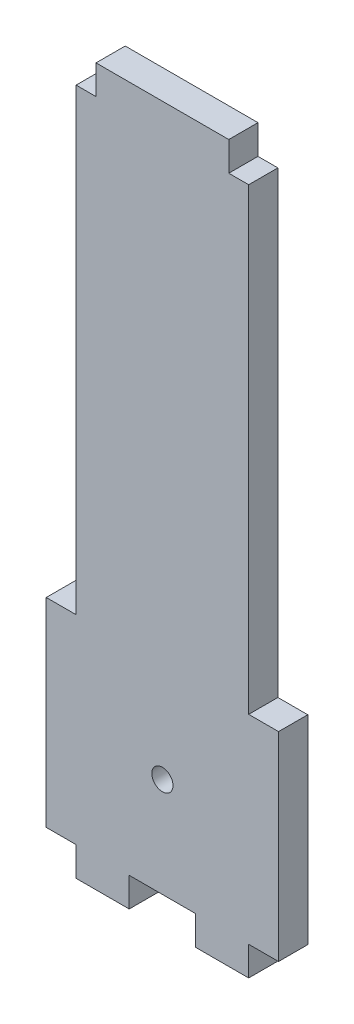
ISO-10303-21;
HEADER;
FILE_DESCRIPTION(('STEP AP214'),'2;1');
FILE_NAME('part.step','',(''),(''),'','','');
FILE_SCHEMA(('AUTOMOTIVE_DESIGN { 1 0 10303 214 1 1 1 1 }'));
ENDSEC;
DATA;
#1=APPLICATION_CONTEXT('core data for automotive mechanical design processes');
#2=APPLICATION_PROTOCOL_DEFINITION('international standard','automotive_design',2000,#1);
#3=PRODUCT_CONTEXT('',#1,'mechanical');
#4=PRODUCT('Part','Part','',(#3));
#5=PRODUCT_RELATED_PRODUCT_CATEGORY('part','',(#4));
#6=PRODUCT_DEFINITION_FORMATION('','',#4);
#7=PRODUCT_DEFINITION_CONTEXT('part definition',#1,'design');
#8=PRODUCT_DEFINITION('design','',#6,#7);
#9=PRODUCT_DEFINITION_SHAPE('','',#8);
#10=(LENGTH_UNIT() NAMED_UNIT(*) SI_UNIT(.MILLI.,.METRE.));
#11=(NAMED_UNIT(*) PLANE_ANGLE_UNIT() SI_UNIT($,.RADIAN.));
#12=(NAMED_UNIT(*) SI_UNIT($,.STERADIAN.) SOLID_ANGLE_UNIT());
#13=UNCERTAINTY_MEASURE_WITH_UNIT(LENGTH_MEASURE(1.E-05),#10,'distance_accuracy_value','');
#14=(GEOMETRIC_REPRESENTATION_CONTEXT(3) GLOBAL_UNCERTAINTY_ASSIGNED_CONTEXT((#13)) GLOBAL_UNIT_ASSIGNED_CONTEXT((#10,
#11,#12)) REPRESENTATION_CONTEXT('',''));
#15=CARTESIAN_POINT('',(0.,0.,0.));
#16=DIRECTION('',(0.,0.,1.));
#17=DIRECTION('',(1.,0.,0.));
#18=AXIS2_PLACEMENT_3D('',#15,#16,#17);
#19=CARTESIAN_POINT('',(-13.,19.4,4.4));
#20=DIRECTION('',(1.,0.,0.));
#21=DIRECTION('',(0.,0.,-1.));
#22=AXIS2_PLACEMENT_3D('',#19,#20,#21);
#23=PLANE('',#22);
#24=DIRECTION('',(0.,-1.,0.));
#25=VECTOR('',#24,1.);
#26=CARTESIAN_POINT('',(-13.,19.4,0.));
#27=LINE('',#26,#25);
#28=CARTESIAN_POINT('',(-13.,84.1,0.));
#29=VERTEX_POINT('',#28);
#30=CARTESIAN_POINT('',(-13.,15.,0.));
#31=VERTEX_POINT('',#30);
#32=EDGE_CURVE('E176',#29,#31,#27,.T.);
#33=ORIENTED_EDGE('',*,*,#32,.T.);
#34=DIRECTION('',(0.,0.,-1.));
#35=VECTOR('',#34,1.);
#36=CARTESIAN_POINT('',(-13.,15.,4.4));
#37=LINE('',#36,#35);
#38=CARTESIAN_POINT('',(-13.,15.,4.4));
#39=VERTEX_POINT('',#38);
#40=EDGE_CURVE('E11',#39,#31,#37,.T.);
#41=ORIENTED_EDGE('',*,*,#40,.F.);
#42=DIRECTION('',(0.,-1.,0.));
#43=VECTOR('',#42,1.);
#44=CARTESIAN_POINT('',(-13.,19.4,4.4));
#45=LINE('',#44,#43);
#46=CARTESIAN_POINT('',(-13.,84.1,4.4));
#47=VERTEX_POINT('',#46);
#48=EDGE_CURVE('E114',#47,#39,#45,.T.);
#49=ORIENTED_EDGE('',*,*,#48,.F.);
#50=DIRECTION('',(0.,0.,1.));
#51=VECTOR('',#50,1.);
#52=CARTESIAN_POINT('',(-13.,84.1,-77.9631323126515));
#53=LINE('',#52,#51);
#54=EDGE_CURVE('E328',#29,#47,#53,.T.);
#55=ORIENTED_EDGE('',*,*,#54,.F.);
#56=EDGE_LOOP('',(#33,#41,#49,#55));
#57=FACE_BOUND('',#56,.T.);
#58=ADVANCED_FACE('F35',(#57),#23,.F.);
#59=CARTESIAN_POINT('',(-13.,15.,4.4));
#60=DIRECTION('',(0.,-1.,0.));
#61=DIRECTION('',(1.,0.,0.));
#62=AXIS2_PLACEMENT_3D('',#59,#60,#61);
#63=PLANE('',#62);
#64=DIRECTION('',(-1.,0.,0.));
#65=VECTOR('',#64,1.);
#66=CARTESIAN_POINT('',(-13.,15.,0.));
#67=LINE('',#66,#65);
#68=CARTESIAN_POINT('',(-17.5,15.,0.));
#69=VERTEX_POINT('',#68);
#70=EDGE_CURVE('E178',#31,#69,#67,.T.);
#71=ORIENTED_EDGE('',*,*,#70,.T.);
#72=DIRECTION('',(0.,0.,-1.));
#73=VECTOR('',#72,1.);
#74=CARTESIAN_POINT('',(-17.5,15.,4.4));
#75=LINE('',#74,#73);
#76=CARTESIAN_POINT('',(-17.5,15.,4.4));
#77=VERTEX_POINT('',#76);
#78=EDGE_CURVE('E44',#77,#69,#75,.T.);
#79=ORIENTED_EDGE('',*,*,#78,.F.);
#80=DIRECTION('',(-1.,0.,0.));
#81=VECTOR('',#80,1.);
#82=CARTESIAN_POINT('',(-13.,15.,4.4));
#83=LINE('',#82,#81);
#84=EDGE_CURVE('E330',#39,#77,#83,.T.);
#85=ORIENTED_EDGE('',*,*,#84,.F.);
#86=ORIENTED_EDGE('',*,*,#40,.T.);
#87=EDGE_LOOP('',(#71,#79,#85,#86));
#88=FACE_BOUND('',#87,.T.);
#89=ADVANCED_FACE('F375',(#88),#63,.F.);
#90=CARTESIAN_POINT('',(-17.5,15.,4.4));
#91=DIRECTION('',(1.,0.,0.));
#92=DIRECTION('',(0.,0.,-1.));
#93=AXIS2_PLACEMENT_3D('',#90,#91,#92);
#94=PLANE('',#93);
#95=DIRECTION('',(0.,-1.,0.));
#96=VECTOR('',#95,1.);
#97=CARTESIAN_POINT('',(-17.5,15.,0.));
#98=LINE('',#97,#96);
#99=CARTESIAN_POINT('',(-17.5,-15.,0.));
#100=VERTEX_POINT('',#99);
#101=EDGE_CURVE('E180',#69,#100,#98,.T.);
#102=ORIENTED_EDGE('',*,*,#101,.T.);
#103=DIRECTION('',(0.,0.,-1.));
#104=VECTOR('',#103,1.);
#105=CARTESIAN_POINT('',(-17.5,-15.,4.4));
#106=LINE('',#105,#104);
#107=CARTESIAN_POINT('',(-17.5,-15.,4.4));
#108=VERTEX_POINT('',#107);
#109=EDGE_CURVE('E228',#108,#100,#106,.T.);
#110=ORIENTED_EDGE('',*,*,#109,.F.);
#111=DIRECTION('',(0.,-1.,0.));
#112=VECTOR('',#111,1.);
#113=CARTESIAN_POINT('',(-17.5,15.,4.4));
#114=LINE('',#113,#112);
#115=EDGE_CURVE('E238',#77,#108,#114,.T.);
#116=ORIENTED_EDGE('',*,*,#115,.F.);
#117=ORIENTED_EDGE('',*,*,#78,.T.);
#118=EDGE_LOOP('',(#102,#110,#116,#117));
#119=FACE_BOUND('',#118,.T.);
#120=ADVANCED_FACE('F236',(#119),#94,.F.);
#121=CARTESIAN_POINT('',(-13.,-15.,4.4));
#122=DIRECTION('',(0.,1.,0.));
#123=DIRECTION('',(-1.,0.,0.));
#124=AXIS2_PLACEMENT_3D('',#121,#122,#123);
#125=PLANE('',#124);
#126=DIRECTION('',(1.,0.,0.));
#127=VECTOR('',#126,1.);
#128=CARTESIAN_POINT('',(-13.,-15.,0.));
#129=LINE('',#128,#127);
#130=CARTESIAN_POINT('',(-13.,-15.,0.));
#131=VERTEX_POINT('',#130);
#132=EDGE_CURVE('E182',#100,#131,#129,.T.);
#133=ORIENTED_EDGE('',*,*,#132,.T.);
#134=DIRECTION('',(0.,0.,-1.));
#135=VECTOR('',#134,1.);
#136=CARTESIAN_POINT('',(-13.,-15.,4.4));
#137=LINE('',#136,#135);
#138=CARTESIAN_POINT('',(-13.,-15.,4.4));
#139=VERTEX_POINT('',#138);
#140=EDGE_CURVE('E225',#139,#131,#137,.T.);
#141=ORIENTED_EDGE('',*,*,#140,.F.);
#142=DIRECTION('',(1.,0.,0.));
#143=VECTOR('',#142,1.);
#144=CARTESIAN_POINT('',(-13.,-15.,4.4));
#145=LINE('',#144,#143);
#146=EDGE_CURVE('E260',#108,#139,#145,.T.);
#147=ORIENTED_EDGE('',*,*,#146,.F.);
#148=ORIENTED_EDGE('',*,*,#109,.T.);
#149=EDGE_LOOP('',(#133,#141,#147,#148));
#150=FACE_BOUND('',#149,.T.);
#151=ADVANCED_FACE('F251',(#150),#125,.F.);
#152=CARTESIAN_POINT('',(-13.,-19.4,4.4));
#153=DIRECTION('',(1.,0.,0.));
#154=DIRECTION('',(0.,0.,-1.));
#155=AXIS2_PLACEMENT_3D('',#152,#153,#154);
#156=PLANE('',#155);
#157=DIRECTION('',(0.,-1.,0.));
#158=VECTOR('',#157,1.);
#159=CARTESIAN_POINT('',(-13.,-19.4,0.));
#160=LINE('',#159,#158);
#161=CARTESIAN_POINT('',(-13.,-19.4,0.));
#162=VERTEX_POINT('',#161);
#163=EDGE_CURVE('E184',#131,#162,#160,.T.);
#164=ORIENTED_EDGE('',*,*,#163,.T.);
#165=DIRECTION('',(0.,0.,-1.));
#166=VECTOR('',#165,1.);
#167=CARTESIAN_POINT('',(-13.,-19.4,4.4));
#168=LINE('',#167,#166);
#169=CARTESIAN_POINT('',(-13.,-19.4,4.4));
#170=VERTEX_POINT('',#169);
#171=EDGE_CURVE('E222',#170,#162,#168,.T.);
#172=ORIENTED_EDGE('',*,*,#171,.F.);
#173=DIRECTION('',(0.,-1.,0.));
#174=VECTOR('',#173,1.);
#175=CARTESIAN_POINT('',(-13.,-19.4,4.4));
#176=LINE('',#175,#174);
#177=EDGE_CURVE('E257',#139,#170,#176,.T.);
#178=ORIENTED_EDGE('',*,*,#177,.F.);
#179=ORIENTED_EDGE('',*,*,#140,.T.);
#180=EDGE_LOOP('',(#164,#172,#178,#179));
#181=FACE_BOUND('',#180,.T.);
#182=ADVANCED_FACE('F255',(#181),#156,.F.);
#183=CARTESIAN_POINT('',(-5.,-19.4,4.4));
#184=DIRECTION('',(0.,1.,0.));
#185=DIRECTION('',(0.,0.,1.));
#186=AXIS2_PLACEMENT_3D('',#183,#184,#185);
#187=PLANE('',#186);
#188=DIRECTION('',(1.,0.,0.));
#189=VECTOR('',#188,1.);
#190=CARTESIAN_POINT('',(-5.,-19.4,0.));
#191=LINE('',#190,#189);
#192=CARTESIAN_POINT('',(-5.,-19.4,0.));
#193=VERTEX_POINT('',#192);
#194=EDGE_CURVE('E186',#162,#193,#191,.T.);
#195=ORIENTED_EDGE('',*,*,#194,.T.);
#196=DIRECTION('',(0.,0.,-1.));
#197=VECTOR('',#196,1.);
#198=CARTESIAN_POINT('',(-5.,-19.4,4.4));
#199=LINE('',#198,#197);
#200=CARTESIAN_POINT('',(-5.,-19.4,4.4));
#201=VERTEX_POINT('',#200);
#202=EDGE_CURVE('E219',#201,#193,#199,.T.);
#203=ORIENTED_EDGE('',*,*,#202,.F.);
#204=DIRECTION('',(1.,0.,0.));
#205=VECTOR('',#204,1.);
#206=CARTESIAN_POINT('',(-5.,-19.4,4.4));
#207=LINE('',#206,#205);
#208=EDGE_CURVE('E259',#170,#201,#207,.T.);
#209=ORIENTED_EDGE('',*,*,#208,.F.);
#210=ORIENTED_EDGE('',*,*,#171,.T.);
#211=EDGE_LOOP('',(#195,#203,#209,#210));
#212=FACE_BOUND('',#211,.T.);
#213=ADVANCED_FACE('F387',(#212),#187,.F.);
#214=CARTESIAN_POINT('',(-5.,-19.4,4.4));
#215=DIRECTION('',(-1.,0.,0.));
#216=DIRECTION('',(0.,0.,1.));
#217=AXIS2_PLACEMENT_3D('',#214,#215,#216);
#218=PLANE('',#217);
#219=DIRECTION('',(0.,1.,0.));
#220=VECTOR('',#219,1.);
#221=CARTESIAN_POINT('',(-5.,-19.4,0.));
#222=LINE('',#221,#220);
#223=CARTESIAN_POINT('',(-5.,-15.,0.));
#224=VERTEX_POINT('',#223);
#225=EDGE_CURVE('E188',#193,#224,#222,.T.);
#226=ORIENTED_EDGE('',*,*,#225,.T.);
#227=DIRECTION('',(0.,0.,-1.));
#228=VECTOR('',#227,1.);
#229=CARTESIAN_POINT('',(-5.,-15.,4.4));
#230=LINE('',#229,#228);
#231=CARTESIAN_POINT('',(-5.,-15.,4.4));
#232=VERTEX_POINT('',#231);
#233=EDGE_CURVE('E216',#232,#224,#230,.T.);
#234=ORIENTED_EDGE('',*,*,#233,.F.);
#235=DIRECTION('',(0.,1.,0.));
#236=VECTOR('',#235,1.);
#237=CARTESIAN_POINT('',(-5.,-19.4,4.4));
#238=LINE('',#237,#236);
#239=EDGE_CURVE('E262',#201,#232,#238,.T.);
#240=ORIENTED_EDGE('',*,*,#239,.F.);
#241=ORIENTED_EDGE('',*,*,#202,.T.);
#242=EDGE_LOOP('',(#226,#234,#240,#241));
#243=FACE_BOUND('',#242,.T.);
#244=ADVANCED_FACE('F390',(#243),#218,.F.);
#245=CARTESIAN_POINT('',(5.,-15.,4.4));
#246=DIRECTION('',(0.,1.,0.));
#247=DIRECTION('',(0.,0.,1.));
#248=AXIS2_PLACEMENT_3D('',#245,#246,#247);
#249=PLANE('',#248);
#250=DIRECTION('',(1.,0.,0.));
#251=VECTOR('',#250,1.);
#252=CARTESIAN_POINT('',(5.,-15.,0.));
#253=LINE('',#252,#251);
#254=CARTESIAN_POINT('',(5.,-15.,0.));
#255=VERTEX_POINT('',#254);
#256=EDGE_CURVE('E190',#224,#255,#253,.T.);
#257=ORIENTED_EDGE('',*,*,#256,.T.);
#258=DIRECTION('',(0.,0.,-1.));
#259=VECTOR('',#258,1.);
#260=CARTESIAN_POINT('',(5.,-15.,4.4));
#261=LINE('',#260,#259);
#262=CARTESIAN_POINT('',(5.,-15.,4.4));
#263=VERTEX_POINT('',#262);
#264=EDGE_CURVE('E213',#263,#255,#261,.T.);
#265=ORIENTED_EDGE('',*,*,#264,.F.);
#266=DIRECTION('',(1.,0.,0.));
#267=VECTOR('',#266,1.);
#268=CARTESIAN_POINT('',(5.,-15.,4.4));
#269=LINE('',#268,#267);
#270=EDGE_CURVE('E268',#232,#263,#269,.T.);
#271=ORIENTED_EDGE('',*,*,#270,.F.);
#272=ORIENTED_EDGE('',*,*,#233,.T.);
#273=EDGE_LOOP('',(#257,#265,#271,#272));
#274=FACE_BOUND('',#273,.T.);
#275=ADVANCED_FACE('F394',(#274),#249,.F.);
#276=CARTESIAN_POINT('',(5.,-19.4,4.4));
#277=DIRECTION('',(1.,0.,0.));
#278=DIRECTION('',(0.,0.,-1.));
#279=AXIS2_PLACEMENT_3D('',#276,#277,#278);
#280=PLANE('',#279);
#281=DIRECTION('',(0.,-1.,0.));
#282=VECTOR('',#281,1.);
#283=CARTESIAN_POINT('',(5.,-19.4,0.));
#284=LINE('',#283,#282);
#285=CARTESIAN_POINT('',(5.,-19.4,0.));
#286=VERTEX_POINT('',#285);
#287=EDGE_CURVE('E192',#255,#286,#284,.T.);
#288=ORIENTED_EDGE('',*,*,#287,.T.);
#289=DIRECTION('',(0.,0.,-1.));
#290=VECTOR('',#289,1.);
#291=CARTESIAN_POINT('',(5.,-19.4,4.4));
#292=LINE('',#291,#290);
#293=CARTESIAN_POINT('',(5.,-19.4,4.4));
#294=VERTEX_POINT('',#293);
#295=EDGE_CURVE('E210',#294,#286,#292,.T.);
#296=ORIENTED_EDGE('',*,*,#295,.F.);
#297=DIRECTION('',(0.,-1.,0.));
#298=VECTOR('',#297,1.);
#299=CARTESIAN_POINT('',(5.,-19.4,4.4));
#300=LINE('',#299,#298);
#301=EDGE_CURVE('E270',#263,#294,#300,.T.);
#302=ORIENTED_EDGE('',*,*,#301,.F.);
#303=ORIENTED_EDGE('',*,*,#264,.T.);
#304=EDGE_LOOP('',(#288,#296,#302,#303));
#305=FACE_BOUND('',#304,.T.);
#306=ADVANCED_FACE('F398',(#305),#280,.F.);
#307=CARTESIAN_POINT('',(5.,-19.4,4.4));
#308=DIRECTION('',(0.,1.,0.));
#309=DIRECTION('',(0.,0.,1.));
#310=AXIS2_PLACEMENT_3D('',#307,#308,#309);
#311=PLANE('',#310);
#312=DIRECTION('',(1.,0.,0.));
#313=VECTOR('',#312,1.);
#314=CARTESIAN_POINT('',(5.,-19.4,0.));
#315=LINE('',#314,#313);
#316=CARTESIAN_POINT('',(13.,-19.4,0.));
#317=VERTEX_POINT('',#316);
#318=EDGE_CURVE('E194',#286,#317,#315,.T.);
#319=ORIENTED_EDGE('',*,*,#318,.T.);
#320=DIRECTION('',(0.,0.,-1.));
#321=VECTOR('',#320,1.);
#322=CARTESIAN_POINT('',(13.,-19.4,4.4));
#323=LINE('',#322,#321);
#324=CARTESIAN_POINT('',(13.,-19.4,4.4));
#325=VERTEX_POINT('',#324);
#326=EDGE_CURVE('E207',#325,#317,#323,.T.);
#327=ORIENTED_EDGE('',*,*,#326,.F.);
#328=DIRECTION('',(1.,0.,0.));
#329=VECTOR('',#328,1.);
#330=CARTESIAN_POINT('',(5.,-19.4,4.4));
#331=LINE('',#330,#329);
#332=EDGE_CURVE('E272',#294,#325,#331,.T.);
#333=ORIENTED_EDGE('',*,*,#332,.F.);
#334=ORIENTED_EDGE('',*,*,#295,.T.);
#335=EDGE_LOOP('',(#319,#327,#333,#334));
#336=FACE_BOUND('',#335,.T.);
#337=ADVANCED_FACE('F278',(#336),#311,.F.);
#338=CARTESIAN_POINT('',(13.,-19.4,4.4));
#339=DIRECTION('',(-1.,0.,0.));
#340=DIRECTION('',(0.,0.,1.));
#341=AXIS2_PLACEMENT_3D('',#338,#339,#340);
#342=PLANE('',#341);
#343=DIRECTION('',(0.,1.,0.));
#344=VECTOR('',#343,1.);
#345=CARTESIAN_POINT('',(13.,-19.4,0.));
#346=LINE('',#345,#344);
#347=CARTESIAN_POINT('',(13.,-15.,0.));
#348=VERTEX_POINT('',#347);
#349=EDGE_CURVE('E196',#317,#348,#346,.T.);
#350=ORIENTED_EDGE('',*,*,#349,.T.);
#351=DIRECTION('',(0.,0.,-1.));
#352=VECTOR('',#351,1.);
#353=CARTESIAN_POINT('',(13.,-15.,4.4));
#354=LINE('',#353,#352);
#355=CARTESIAN_POINT('',(13.,-15.,4.4));
#356=VERTEX_POINT('',#355);
#357=EDGE_CURVE('E165',#356,#348,#354,.T.);
#358=ORIENTED_EDGE('',*,*,#357,.F.);
#359=DIRECTION('',(0.,1.,0.));
#360=VECTOR('',#359,1.);
#361=CARTESIAN_POINT('',(13.,-19.4,4.4));
#362=LINE('',#361,#360);
#363=EDGE_CURVE('E156',#325,#356,#362,.T.);
#364=ORIENTED_EDGE('',*,*,#363,.F.);
#365=ORIENTED_EDGE('',*,*,#326,.T.);
#366=EDGE_LOOP('',(#350,#358,#364,#365));
#367=FACE_BOUND('',#366,.T.);
#368=ADVANCED_FACE('F282',(#367),#342,.F.);
#369=CARTESIAN_POINT('',(13.,-15.,4.4));
#370=DIRECTION('',(0.,1.,0.));
#371=DIRECTION('',(-1.,0.,0.));
#372=AXIS2_PLACEMENT_3D('',#369,#370,#371);
#373=PLANE('',#372);
#374=DIRECTION('',(1.,0.,0.));
#375=VECTOR('',#374,1.);
#376=CARTESIAN_POINT('',(13.,-15.,0.));
#377=LINE('',#376,#375);
#378=CARTESIAN_POINT('',(17.5,-15.,0.));
#379=VERTEX_POINT('',#378);
#380=EDGE_CURVE('E164',#348,#379,#377,.T.);
#381=ORIENTED_EDGE('',*,*,#380,.T.);
#382=DIRECTION('',(0.,0.,-1.));
#383=VECTOR('',#382,1.);
#384=CARTESIAN_POINT('',(17.5,-15.,4.4));
#385=LINE('',#384,#383);
#386=CARTESIAN_POINT('',(17.5,-15.,4.4));
#387=VERTEX_POINT('',#386);
#388=EDGE_CURVE('E161',#387,#379,#385,.T.);
#389=ORIENTED_EDGE('',*,*,#388,.F.);
#390=DIRECTION('',(1.,0.,0.));
#391=VECTOR('',#390,1.);
#392=CARTESIAN_POINT('',(13.,-15.,4.4));
#393=LINE('',#392,#391);
#394=EDGE_CURVE('E149',#356,#387,#393,.T.);
#395=ORIENTED_EDGE('',*,*,#394,.F.);
#396=ORIENTED_EDGE('',*,*,#357,.T.);
#397=EDGE_LOOP('',(#381,#389,#395,#396));
#398=FACE_BOUND('',#397,.T.);
#399=ADVANCED_FACE('F162',(#398),#373,.F.);
#400=CARTESIAN_POINT('',(17.5,15.,4.4));
#401=DIRECTION('',(-1.,0.,0.));
#402=DIRECTION('',(0.,0.,1.));
#403=AXIS2_PLACEMENT_3D('',#400,#401,#402);
#404=PLANE('',#403);
#405=DIRECTION('',(0.,1.,0.));
#406=VECTOR('',#405,1.);
#407=CARTESIAN_POINT('',(17.5,15.,0.));
#408=LINE('',#407,#406);
#409=CARTESIAN_POINT('',(17.5,15.,0.));
#410=VERTEX_POINT('',#409);
#411=EDGE_CURVE('E100',#379,#410,#408,.T.);
#412=ORIENTED_EDGE('',*,*,#411,.T.);
#413=DIRECTION('',(0.,0.,-1.));
#414=VECTOR('',#413,1.);
#415=CARTESIAN_POINT('',(17.5,15.,4.4));
#416=LINE('',#415,#414);
#417=CARTESIAN_POINT('',(17.5,15.,4.4));
#418=VERTEX_POINT('',#417);
#419=EDGE_CURVE('E166',#418,#410,#416,.T.);
#420=ORIENTED_EDGE('',*,*,#419,.F.);
#421=DIRECTION('',(0.,1.,0.));
#422=VECTOR('',#421,1.);
#423=CARTESIAN_POINT('',(17.5,15.,4.4));
#424=LINE('',#423,#422);
#425=EDGE_CURVE('E154',#387,#418,#424,.T.);
#426=ORIENTED_EDGE('',*,*,#425,.F.);
#427=ORIENTED_EDGE('',*,*,#388,.T.);
#428=EDGE_LOOP('',(#412,#420,#426,#427));
#429=FACE_BOUND('',#428,.T.);
#430=ADVANCED_FACE('F168',(#429),#404,.F.);
#431=CARTESIAN_POINT('',(13.,15.,4.4));
#432=DIRECTION('',(0.,-1.,0.));
#433=DIRECTION('',(1.,0.,0.));
#434=AXIS2_PLACEMENT_3D('',#431,#432,#433);
#435=PLANE('',#434);
#436=DIRECTION('',(-1.,0.,0.));
#437=VECTOR('',#436,1.);
#438=CARTESIAN_POINT('',(13.,15.,0.));
#439=LINE('',#438,#437);
#440=CARTESIAN_POINT('',(13.,15.,0.));
#441=VERTEX_POINT('',#440);
#442=EDGE_CURVE('E106',#410,#441,#439,.T.);
#443=ORIENTED_EDGE('',*,*,#442,.T.);
#444=DIRECTION('',(0.,0.,-1.));
#445=VECTOR('',#444,1.);
#446=CARTESIAN_POINT('',(13.,15.,4.4));
#447=LINE('',#446,#445);
#448=CARTESIAN_POINT('',(13.,15.,4.4));
#449=VERTEX_POINT('',#448);
#450=EDGE_CURVE('E175',#449,#441,#447,.T.);
#451=ORIENTED_EDGE('',*,*,#450,.F.);
#452=DIRECTION('',(-1.,0.,0.));
#453=VECTOR('',#452,1.);
#454=CARTESIAN_POINT('',(13.,15.,4.4));
#455=LINE('',#454,#453);
#456=EDGE_CURVE('E52',#418,#449,#455,.T.);
#457=ORIENTED_EDGE('',*,*,#456,.F.);
#458=ORIENTED_EDGE('',*,*,#419,.T.);
#459=EDGE_LOOP('',(#443,#451,#457,#458));
#460=FACE_BOUND('',#459,.T.);
#461=ADVANCED_FACE('F411',(#460),#435,.F.);
#462=CARTESIAN_POINT('',(13.,19.4,4.4));
#463=DIRECTION('',(-1.,0.,0.));
#464=DIRECTION('',(0.,0.,1.));
#465=AXIS2_PLACEMENT_3D('',#462,#463,#464);
#466=PLANE('',#465);
#467=DIRECTION('',(0.,1.,0.));
#468=VECTOR('',#467,1.);
#469=CARTESIAN_POINT('',(13.,19.4,0.));
#470=LINE('',#469,#468);
#471=CARTESIAN_POINT('',(13.,84.1,0.));
#472=VERTEX_POINT('',#471);
#473=EDGE_CURVE('E201',#441,#472,#470,.T.);
#474=ORIENTED_EDGE('',*,*,#473,.T.);
#475=DIRECTION('',(0.,0.,1.));
#476=VECTOR('',#475,1.);
#477=CARTESIAN_POINT('',(13.,84.1,-77.9631323126515));
#478=LINE('',#477,#476);
#479=CARTESIAN_POINT('',(13.,84.1,4.4));
#480=VERTEX_POINT('',#479);
#481=EDGE_CURVE('E294',#472,#480,#478,.T.);
#482=ORIENTED_EDGE('',*,*,#481,.T.);
#483=DIRECTION('',(0.,1.,0.));
#484=VECTOR('',#483,1.);
#485=CARTESIAN_POINT('',(13.,19.4,4.4));
#486=LINE('',#485,#484);
#487=EDGE_CURVE('E170',#449,#480,#486,.T.);
#488=ORIENTED_EDGE('',*,*,#487,.F.);
#489=ORIENTED_EDGE('',*,*,#450,.T.);
#490=EDGE_LOOP('',(#474,#482,#488,#489));
#491=FACE_BOUND('',#490,.T.);
#492=ADVANCED_FACE('F291',(#491),#466,.F.);
#493=CARTESIAN_POINT('',(0.,0.,4.4));
#494=DIRECTION('',(0.,0.,-1.));
#495=DIRECTION('',(-1.,0.,0.));
#496=AXIS2_PLACEMENT_3D('',#493,#494,#495);
#497=PLANE('',#496);
#498=DIRECTION('',(-1.,0.,0.));
#499=VECTOR('',#498,1.);
#500=CARTESIAN_POINT('',(-10.,84.1,4.4));
#501=LINE('',#500,#499);
#502=CARTESIAN_POINT('',(-10.,84.1,4.4));
#503=VERTEX_POINT('',#502);
#504=EDGE_CURVE('E336',#503,#47,#501,.T.);
#505=ORIENTED_EDGE('',*,*,#504,.T.);
#506=ORIENTED_EDGE('',*,*,#48,.T.);
#507=ORIENTED_EDGE('',*,*,#84,.T.);
#508=ORIENTED_EDGE('',*,*,#115,.T.);
#509=ORIENTED_EDGE('',*,*,#146,.T.);
#510=ORIENTED_EDGE('',*,*,#177,.T.);
#511=ORIENTED_EDGE('',*,*,#208,.T.);
#512=ORIENTED_EDGE('',*,*,#239,.T.);
#513=ORIENTED_EDGE('',*,*,#270,.T.);
#514=ORIENTED_EDGE('',*,*,#301,.T.);
#515=ORIENTED_EDGE('',*,*,#332,.T.);
#516=ORIENTED_EDGE('',*,*,#363,.T.);
#517=ORIENTED_EDGE('',*,*,#394,.T.);
#518=ORIENTED_EDGE('',*,*,#425,.T.);
#519=ORIENTED_EDGE('',*,*,#456,.T.);
#520=ORIENTED_EDGE('',*,*,#487,.T.);
#521=DIRECTION('',(-1.,0.,0.));
#522=VECTOR('',#521,1.);
#523=CARTESIAN_POINT('',(10.,84.1,4.4));
#524=LINE('',#523,#522);
#525=CARTESIAN_POINT('',(10.,84.1,4.4));
#526=VERTEX_POINT('',#525);
#527=EDGE_CURVE('E353',#480,#526,#524,.T.);
#528=ORIENTED_EDGE('',*,*,#527,.T.);
#529=DIRECTION('',(0.,1.,0.));
#530=VECTOR('',#529,1.);
#531=CARTESIAN_POINT('',(10.,88.5,4.4));
#532=LINE('',#531,#530);
#533=CARTESIAN_POINT('',(10.,88.5,4.4));
#534=VERTEX_POINT('',#533);
#535=EDGE_CURVE('E350',#526,#534,#532,.T.);
#536=ORIENTED_EDGE('',*,*,#535,.T.);
#537=DIRECTION('',(-1.,0.,0.));
#538=VECTOR('',#537,1.);
#539=CARTESIAN_POINT('',(-10.,88.5,4.4));
#540=LINE('',#539,#538);
#541=CARTESIAN_POINT('',(-10.,88.5,4.4));
#542=VERTEX_POINT('',#541);
#543=EDGE_CURVE('E346',#534,#542,#540,.T.);
#544=ORIENTED_EDGE('',*,*,#543,.T.);
#545=DIRECTION('',(0.,-1.,0.));
#546=VECTOR('',#545,1.);
#547=CARTESIAN_POINT('',(-10.,88.5,4.4));
#548=LINE('',#547,#546);
#549=EDGE_CURVE('E343',#542,#503,#548,.T.);
#550=ORIENTED_EDGE('',*,*,#549,.T.);
#551=EDGE_LOOP('',(#505,#506,#507,#508,#509,#510,#511,#512,#513,#514,#515,#516,#517,#518,#519,
#520,#528,#536,#544,#550));
#552=FACE_BOUND('',#551,.T.);
#553=CARTESIAN_POINT('',(0.,0.,4.4));
#554=DIRECTION('',(0.,0.,1.));
#555=DIRECTION('',(1.,0.,0.));
#556=AXIS2_PLACEMENT_3D('',#553,#554,#555);
#557=CIRCLE('',#556,1.6);
#558=CARTESIAN_POINT('',(1.6,0.,4.4));
#559=VERTEX_POINT('',#558);
#560=EDGE_CURVE('E338',#559,#559,#557,.T.);
#561=ORIENTED_EDGE('',*,*,#560,.F.);
#562=EDGE_LOOP('',(#561));
#563=FACE_BOUND('',#562,.T.);
#564=ADVANCED_FACE('F151',(#552,#563),#497,.F.);
#565=CARTESIAN_POINT('',(0.,0.,0.));
#566=DIRECTION('',(0.,0.,-1.));
#567=DIRECTION('',(-1.,0.,0.));
#568=AXIS2_PLACEMENT_3D('',#565,#566,#567);
#569=PLANE('',#568);
#570=ORIENTED_EDGE('',*,*,#32,.F.);
#571=DIRECTION('',(-1.,0.,0.));
#572=VECTOR('',#571,1.);
#573=CARTESIAN_POINT('',(-10.,84.1,0.));
#574=LINE('',#573,#572);
#575=CARTESIAN_POINT('',(-10.,84.1,0.));
#576=VERTEX_POINT('',#575);
#577=EDGE_CURVE('E337',#576,#29,#574,.T.);
#578=ORIENTED_EDGE('',*,*,#577,.F.);
#579=DIRECTION('',(0.,-1.,0.));
#580=VECTOR('',#579,1.);
#581=CARTESIAN_POINT('',(-10.,88.5,0.));
#582=LINE('',#581,#580);
#583=CARTESIAN_POINT('',(-10.,88.5,0.));
#584=VERTEX_POINT('',#583);
#585=EDGE_CURVE('E358',#584,#576,#582,.T.);
#586=ORIENTED_EDGE('',*,*,#585,.F.);
#587=DIRECTION('',(-1.,0.,0.));
#588=VECTOR('',#587,1.);
#589=CARTESIAN_POINT('',(-10.,88.5,0.));
#590=LINE('',#589,#588);
#591=CARTESIAN_POINT('',(10.,88.5,0.));
#592=VERTEX_POINT('',#591);
#593=EDGE_CURVE('E362',#592,#584,#590,.T.);
#594=ORIENTED_EDGE('',*,*,#593,.F.);
#595=DIRECTION('',(0.,1.,0.));
#596=VECTOR('',#595,1.);
#597=CARTESIAN_POINT('',(10.,88.5,0.));
#598=LINE('',#597,#596);
#599=CARTESIAN_POINT('',(10.,84.1,0.));
#600=VERTEX_POINT('',#599);
#601=EDGE_CURVE('E302',#600,#592,#598,.T.);
#602=ORIENTED_EDGE('',*,*,#601,.F.);
#603=DIRECTION('',(-1.,0.,0.));
#604=VECTOR('',#603,1.);
#605=CARTESIAN_POINT('',(10.,84.1,0.));
#606=LINE('',#605,#604);
#607=EDGE_CURVE('E287',#472,#600,#606,.T.);
#608=ORIENTED_EDGE('',*,*,#607,.F.);
#609=ORIENTED_EDGE('',*,*,#473,.F.);
#610=ORIENTED_EDGE('',*,*,#442,.F.);
#611=ORIENTED_EDGE('',*,*,#411,.F.);
#612=ORIENTED_EDGE('',*,*,#380,.F.);
#613=ORIENTED_EDGE('',*,*,#349,.F.);
#614=ORIENTED_EDGE('',*,*,#318,.F.);
#615=ORIENTED_EDGE('',*,*,#287,.F.);
#616=ORIENTED_EDGE('',*,*,#256,.F.);
#617=ORIENTED_EDGE('',*,*,#225,.F.);
#618=ORIENTED_EDGE('',*,*,#194,.F.);
#619=ORIENTED_EDGE('',*,*,#163,.F.);
#620=ORIENTED_EDGE('',*,*,#132,.F.);
#621=ORIENTED_EDGE('',*,*,#101,.F.);
#622=ORIENTED_EDGE('',*,*,#70,.F.);
#623=EDGE_LOOP('',(#570,#578,#586,#594,#602,#608,#609,#610,#611,#612,#613,#614,#615,#616,#617,
#618,#619,#620,#621,#622));
#624=FACE_BOUND('',#623,.T.);
#625=CARTESIAN_POINT('',(0.,0.,0.));
#626=DIRECTION('',(0.,0.,-1.));
#627=DIRECTION('',(-1.,0.,0.));
#628=AXIS2_PLACEMENT_3D('',#625,#626,#627);
#629=CIRCLE('',#628,1.6);
#630=CARTESIAN_POINT('',(-1.6,0.,0.));
#631=VERTEX_POINT('',#630);
#632=EDGE_CURVE('E38',#631,#631,#629,.T.);
#633=ORIENTED_EDGE('',*,*,#632,.F.);
#634=EDGE_LOOP('',(#633));
#635=FACE_BOUND('',#634,.T.);
#636=ADVANCED_FACE('F245',(#624,#635),#569,.T.);
#637=CARTESIAN_POINT('',(0.,0.,-5.6));
#638=DIRECTION('',(0.,0.,1.));
#639=DIRECTION('',(1.,0.,0.));
#640=AXIS2_PLACEMENT_3D('',#637,#638,#639);
#641=CYLINDRICAL_SURFACE('',#640,1.6);
#642=ORIENTED_EDGE('',*,*,#632,.T.);
#643=EDGE_LOOP('',(#642));
#644=FACE_BOUND('',#643,.T.);
#645=ORIENTED_EDGE('',*,*,#560,.T.);
#646=EDGE_LOOP('',(#645));
#647=FACE_BOUND('',#646,.T.);
#648=ADVANCED_FACE('F418',(#644,#647),#641,.F.);
#649=CARTESIAN_POINT('',(10.,84.1,-77.9631323126515));
#650=DIRECTION('',(0.,1.,0.));
#651=DIRECTION('',(0.,0.,1.));
#652=AXIS2_PLACEMENT_3D('',#649,#650,#651);
#653=PLANE('',#652);
#654=ORIENTED_EDGE('',*,*,#481,.F.);
#655=ORIENTED_EDGE('',*,*,#607,.T.);
#656=DIRECTION('',(0.,0.,1.));
#657=VECTOR('',#656,1.);
#658=CARTESIAN_POINT('',(10.,84.1,-77.9631323126515));
#659=LINE('',#658,#657);
#660=EDGE_CURVE('E367',#600,#526,#659,.T.);
#661=ORIENTED_EDGE('',*,*,#660,.T.);
#662=ORIENTED_EDGE('',*,*,#527,.F.);
#663=EDGE_LOOP('',(#654,#655,#661,#662));
#664=FACE_BOUND('',#663,.T.);
#665=ADVANCED_FACE('F423',(#664),#653,.T.);
#666=CARTESIAN_POINT('',(10.,88.5,-77.9631323126515));
#667=DIRECTION('',(1.,0.,0.));
#668=DIRECTION('',(0.,0.,-1.));
#669=AXIS2_PLACEMENT_3D('',#666,#667,#668);
#670=PLANE('',#669);
#671=ORIENTED_EDGE('',*,*,#660,.F.);
#672=ORIENTED_EDGE('',*,*,#601,.T.);
#673=DIRECTION('',(0.,0.,1.));
#674=VECTOR('',#673,1.);
#675=CARTESIAN_POINT('',(10.,88.5,-77.9631323126515));
#676=LINE('',#675,#674);
#677=EDGE_CURVE('E365',#592,#534,#676,.T.);
#678=ORIENTED_EDGE('',*,*,#677,.T.);
#679=ORIENTED_EDGE('',*,*,#535,.F.);
#680=EDGE_LOOP('',(#671,#672,#678,#679));
#681=FACE_BOUND('',#680,.T.);
#682=ADVANCED_FACE('F427',(#681),#670,.T.);
#683=CARTESIAN_POINT('',(-10.,88.5,-77.9631323126515));
#684=DIRECTION('',(0.,1.,0.));
#685=DIRECTION('',(0.,0.,1.));
#686=AXIS2_PLACEMENT_3D('',#683,#684,#685);
#687=PLANE('',#686);
#688=ORIENTED_EDGE('',*,*,#677,.F.);
#689=ORIENTED_EDGE('',*,*,#593,.T.);
#690=DIRECTION('',(0.,0.,1.));
#691=VECTOR('',#690,1.);
#692=CARTESIAN_POINT('',(-10.,88.5,-77.9631323126515));
#693=LINE('',#692,#691);
#694=EDGE_CURVE('E361',#584,#542,#693,.T.);
#695=ORIENTED_EDGE('',*,*,#694,.T.);
#696=ORIENTED_EDGE('',*,*,#543,.F.);
#697=EDGE_LOOP('',(#688,#689,#695,#696));
#698=FACE_BOUND('',#697,.T.);
#699=ADVANCED_FACE('F431',(#698),#687,.T.);
#700=CARTESIAN_POINT('',(-10.,88.5,-77.9631323126515));
#701=DIRECTION('',(-1.,0.,0.));
#702=DIRECTION('',(0.,0.,1.));
#703=AXIS2_PLACEMENT_3D('',#700,#701,#702);
#704=PLANE('',#703);
#705=ORIENTED_EDGE('',*,*,#694,.F.);
#706=ORIENTED_EDGE('',*,*,#585,.T.);
#707=DIRECTION('',(0.,0.,1.));
#708=VECTOR('',#707,1.);
#709=CARTESIAN_POINT('',(-10.,84.1,-77.9631323126515));
#710=LINE('',#709,#708);
#711=EDGE_CURVE('E357',#576,#503,#710,.T.);
#712=ORIENTED_EDGE('',*,*,#711,.T.);
#713=ORIENTED_EDGE('',*,*,#549,.F.);
#714=EDGE_LOOP('',(#705,#706,#712,#713));
#715=FACE_BOUND('',#714,.T.);
#716=ADVANCED_FACE('F435',(#715),#704,.T.);
#717=CARTESIAN_POINT('',(-10.,84.1,-77.9631323126515));
#718=DIRECTION('',(0.,1.,0.));
#719=DIRECTION('',(0.,0.,1.));
#720=AXIS2_PLACEMENT_3D('',#717,#718,#719);
#721=PLANE('',#720);
#722=ORIENTED_EDGE('',*,*,#711,.F.);
#723=ORIENTED_EDGE('',*,*,#577,.T.);
#724=ORIENTED_EDGE('',*,*,#54,.T.);
#725=ORIENTED_EDGE('',*,*,#504,.F.);
#726=EDGE_LOOP('',(#722,#723,#724,#725));
#727=FACE_BOUND('',#726,.T.);
#728=ADVANCED_FACE('F335',(#727),#721,.T.);
#729=CLOSED_SHELL('',(#58,#89,#120,#151,#182,#213,#244,#275,#306,#337,#368,#399,#430,#461,#492,
#564,#636,#648,#665,#682,#699,#716,#728));
#730=MANIFOLD_SOLID_BREP('B2',#729);
#731=ADVANCED_BREP_SHAPE_REPRESENTATION('',(#18,#730),#14);
#732=SHAPE_DEFINITION_REPRESENTATION(#9,#731);
ENDSEC;
END-ISO-10303-21;
